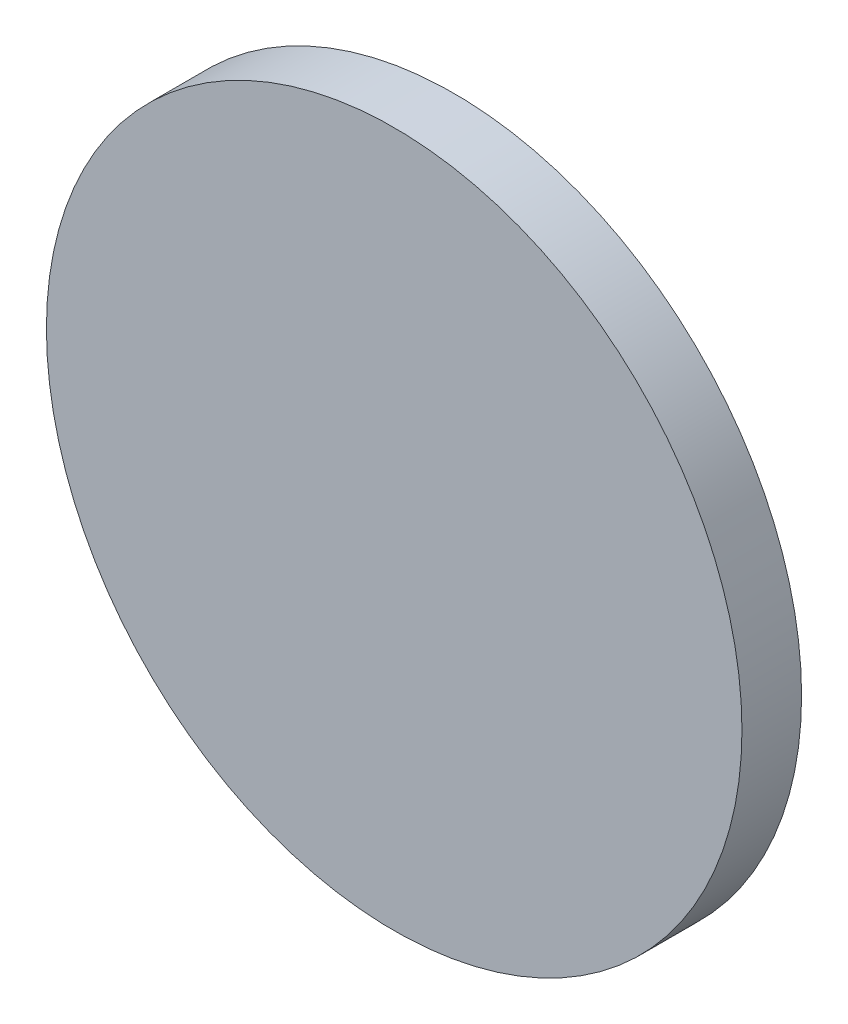
ISO-10303-21;
HEADER;
FILE_DESCRIPTION(('STEP AP214'),'2;1');
FILE_NAME('part.step','',(''),(''),'','','');
FILE_SCHEMA(('AUTOMOTIVE_DESIGN { 1 0 10303 214 1 1 1 1 }'));
ENDSEC;
DATA;
#1=APPLICATION_CONTEXT('core data for automotive mechanical design processes');
#2=APPLICATION_PROTOCOL_DEFINITION('international standard','automotive_design',2000,#1);
#3=PRODUCT_CONTEXT('',#1,'mechanical');
#4=PRODUCT('Part','Part','',(#3));
#5=PRODUCT_RELATED_PRODUCT_CATEGORY('part','',(#4));
#6=PRODUCT_DEFINITION_FORMATION('','',#4);
#7=PRODUCT_DEFINITION_CONTEXT('part definition',#1,'design');
#8=PRODUCT_DEFINITION('design','',#6,#7);
#9=PRODUCT_DEFINITION_SHAPE('','',#8);
#10=(LENGTH_UNIT() NAMED_UNIT(*) SI_UNIT(.MILLI.,.METRE.));
#11=(NAMED_UNIT(*) PLANE_ANGLE_UNIT() SI_UNIT($,.RADIAN.));
#12=(NAMED_UNIT(*) SI_UNIT($,.STERADIAN.) SOLID_ANGLE_UNIT());
#13=UNCERTAINTY_MEASURE_WITH_UNIT(LENGTH_MEASURE(1.E-05),#10,'distance_accuracy_value','');
#14=(GEOMETRIC_REPRESENTATION_CONTEXT(3) GLOBAL_UNCERTAINTY_ASSIGNED_CONTEXT((#13)) GLOBAL_UNIT_ASSIGNED_CONTEXT((#10,
#11,#12)) REPRESENTATION_CONTEXT('',''));
#15=CARTESIAN_POINT('',(0.,0.,0.));
#16=DIRECTION('',(0.,0.,1.));
#17=DIRECTION('',(1.,0.,0.));
#18=AXIS2_PLACEMENT_3D('',#15,#16,#17);
#19=CARTESIAN_POINT('',(1.7145,4.808220006176,0.76487));
#20=DIRECTION('',(0.,0.,-1.));
#21=DIRECTION('',(-1.,0.,0.));
#22=AXIS2_PLACEMENT_3D('',#19,#20,#21);
#23=PLANE('',#22);
#24=CARTESIAN_POINT('',(1.7145,4.808220006176,0.76487));
#25=DIRECTION('',(0.,0.,1.));
#26=DIRECTION('',(1.,0.,0.));
#27=AXIS2_PLACEMENT_3D('',#24,#25,#26);
#28=CIRCLE('',#27,0.200024667);
#29=CARTESIAN_POINT('',(1.914524667,4.808220006176,0.76487));
#30=VERTEX_POINT('',#29);
#31=EDGE_CURVE('E18',#30,#30,#28,.T.);
#32=ORIENTED_EDGE('',*,*,#31,.F.);
#33=EDGE_LOOP('',(#32));
#34=FACE_BOUND('',#33,.T.);
#35=ADVANCED_FACE('F15',(#34),#23,.T.);
#36=CARTESIAN_POINT('',(1.7145,4.808220006176,0.76487));
#37=DIRECTION('',(0.,0.,1.));
#38=DIRECTION('',(1.,0.,0.));
#39=AXIS2_PLACEMENT_3D('',#36,#37,#38);
#40=CYLINDRICAL_SURFACE('',#39,0.200024667);
#41=CARTESIAN_POINT('',(1.7145,4.808220006176,0.79916));
#42=DIRECTION('',(0.,0.,1.));
#43=DIRECTION('',(1.,0.,0.));
#44=AXIS2_PLACEMENT_3D('',#41,#42,#43);
#45=CIRCLE('',#44,0.200024667);
#46=CARTESIAN_POINT('',(1.914524667,4.808220006176,0.79916));
#47=VERTEX_POINT('',#46);
#48=EDGE_CURVE('E10',#47,#47,#45,.T.);
#49=ORIENTED_EDGE('',*,*,#48,.F.);
#50=EDGE_LOOP('',(#49));
#51=FACE_BOUND('',#50,.T.);
#52=ORIENTED_EDGE('',*,*,#31,.T.);
#53=EDGE_LOOP('',(#52));
#54=FACE_BOUND('',#53,.T.);
#55=ADVANCED_FACE('F27',(#51,#54),#40,.T.);
#56=CARTESIAN_POINT('',(1.7145,4.808220006176,0.79916));
#57=DIRECTION('',(0.,0.,1.));
#58=DIRECTION('',(1.,0.,0.));
#59=AXIS2_PLACEMENT_3D('',#56,#57,#58);
#60=PLANE('',#59);
#61=ORIENTED_EDGE('',*,*,#48,.T.);
#62=EDGE_LOOP('',(#61));
#63=FACE_BOUND('',#62,.T.);
#64=ADVANCED_FACE('F34',(#63),#60,.T.);
#65=CLOSED_SHELL('',(#35,#55,#64));
#66=MANIFOLD_SOLID_BREP('B1',#65);
#67=ADVANCED_BREP_SHAPE_REPRESENTATION('',(#18,#66),#14);
#68=SHAPE_DEFINITION_REPRESENTATION(#9,#67);
ENDSEC;
END-ISO-10303-21;
